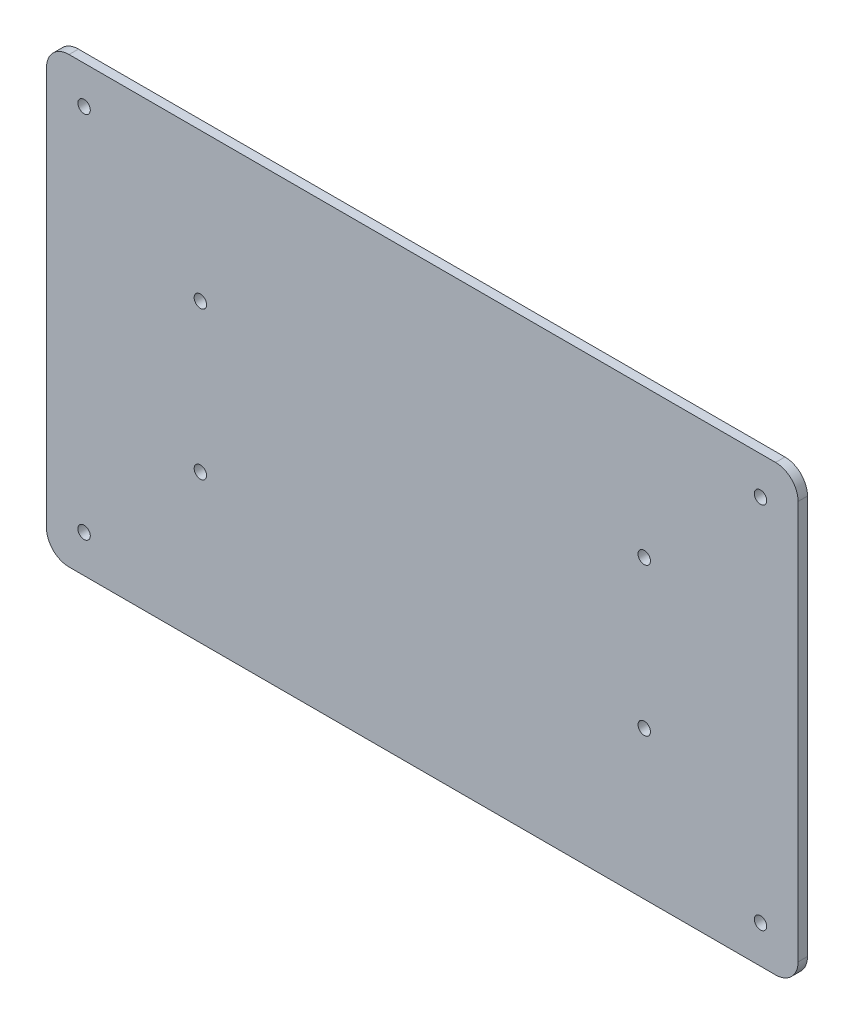
ISO-10303-21;
HEADER;
FILE_DESCRIPTION(('STEP AP214'),'2;1');
FILE_NAME('part.step','',(''),(''),'','','');
FILE_SCHEMA(('AUTOMOTIVE_DESIGN { 1 0 10303 214 1 1 1 1 }'));
ENDSEC;
DATA;
#1=APPLICATION_CONTEXT('core data for automotive mechanical design processes');
#2=APPLICATION_PROTOCOL_DEFINITION('international standard','automotive_design',2000,#1);
#3=PRODUCT_CONTEXT('',#1,'mechanical');
#4=PRODUCT('Part','Part','',(#3));
#5=PRODUCT_RELATED_PRODUCT_CATEGORY('part','',(#4));
#6=PRODUCT_DEFINITION_FORMATION('','',#4);
#7=PRODUCT_DEFINITION_CONTEXT('part definition',#1,'design');
#8=PRODUCT_DEFINITION('design','',#6,#7);
#9=PRODUCT_DEFINITION_SHAPE('','',#8);
#10=(LENGTH_UNIT() NAMED_UNIT(*) SI_UNIT(.MILLI.,.METRE.));
#11=(NAMED_UNIT(*) PLANE_ANGLE_UNIT() SI_UNIT($,.RADIAN.));
#12=(NAMED_UNIT(*) SI_UNIT($,.STERADIAN.) SOLID_ANGLE_UNIT());
#13=UNCERTAINTY_MEASURE_WITH_UNIT(LENGTH_MEASURE(1.E-05),#10,'distance_accuracy_value','');
#14=(GEOMETRIC_REPRESENTATION_CONTEXT(3) GLOBAL_UNCERTAINTY_ASSIGNED_CONTEXT((#13)) GLOBAL_UNIT_ASSIGNED_CONTEXT((#10,
#11,#12)) REPRESENTATION_CONTEXT('',''));
#15=CARTESIAN_POINT('',(0.,0.,0.));
#16=DIRECTION('',(0.,0.,1.));
#17=DIRECTION('',(1.,0.,0.));
#18=AXIS2_PLACEMENT_3D('',#15,#16,#17);
#19=CARTESIAN_POINT('',(-119.38,67.38,3.175));
#20=DIRECTION('',(0.,0.,1.));
#21=DIRECTION('',(1.,0.,0.));
#22=AXIS2_PLACEMENT_3D('',#19,#20,#21);
#23=PLANE('',#22);
#24=CARTESIAN_POINT('',(-74.9999999999999,25.,3.175));
#25=DIRECTION('',(0.,0.,1.));
#26=DIRECTION('',(1.,0.,0.));
#27=AXIS2_PLACEMENT_3D('',#24,#25,#26);
#28=CIRCLE('',#27,2.1);
#29=CARTESIAN_POINT('',(-72.8999999999999,25.,3.175));
#30=VERTEX_POINT('',#29);
#31=EDGE_CURVE('E430',#30,#30,#28,.T.);
#32=ORIENTED_EDGE('',*,*,#31,.F.);
#33=EDGE_LOOP('',(#32));
#34=FACE_BOUND('',#33,.T.);
#35=CARTESIAN_POINT('',(114.3,-62.3,3.175));
#36=DIRECTION('',(0.,0.,1.));
#37=DIRECTION('',(1.,0.,0.));
#38=AXIS2_PLACEMENT_3D('',#35,#36,#37);
#39=CIRCLE('',#38,2.1);
#40=CARTESIAN_POINT('',(116.4,-62.3,3.175));
#41=VERTEX_POINT('',#40);
#42=EDGE_CURVE('E418',#41,#41,#39,.T.);
#43=ORIENTED_EDGE('',*,*,#42,.F.);
#44=EDGE_LOOP('',(#43));
#45=FACE_BOUND('',#44,.T.);
#46=CARTESIAN_POINT('',(-114.3,62.3,3.175));
#47=DIRECTION('',(0.,0.,1.));
#48=DIRECTION('',(1.,0.,0.));
#49=AXIS2_PLACEMENT_3D('',#46,#47,#48);
#50=CIRCLE('',#49,2.0999958);
#51=CARTESIAN_POINT('',(-112.2000042,62.3,3.175));
#52=VERTEX_POINT('',#51);
#53=EDGE_CURVE('E406',#52,#52,#50,.T.);
#54=ORIENTED_EDGE('',*,*,#53,.F.);
#55=EDGE_LOOP('',(#54));
#56=FACE_BOUND('',#55,.T.);
#57=CARTESIAN_POINT('',(75.0000000000001,-25.,3.175));
#58=DIRECTION('',(0.,0.,1.));
#59=DIRECTION('',(1.,0.,0.));
#60=AXIS2_PLACEMENT_3D('',#57,#58,#59);
#61=CIRCLE('',#60,2.1);
#62=CARTESIAN_POINT('',(77.1000000000001,-25.,3.175));
#63=VERTEX_POINT('',#62);
#64=EDGE_CURVE('E349',#63,#63,#61,.T.);
#65=ORIENTED_EDGE('',*,*,#64,.F.);
#66=EDGE_LOOP('',(#65));
#67=FACE_BOUND('',#66,.T.);
#68=CARTESIAN_POINT('',(-119.38,67.38,3.175));
#69=DIRECTION('',(0.,0.,1.));
#70=DIRECTION('',(1.,0.,0.));
#71=AXIS2_PLACEMENT_3D('',#68,#69,#70);
#72=CIRCLE('',#71,7.62);
#73=CARTESIAN_POINT('',(-119.38,75.,3.175));
#74=VERTEX_POINT('',#73);
#75=CARTESIAN_POINT('',(-127.,67.3799999999999,3.175));
#76=VERTEX_POINT('',#75);
#77=EDGE_CURVE('E364',#74,#76,#72,.T.);
#78=ORIENTED_EDGE('',*,*,#77,.T.);
#79=DIRECTION('',(0.,-1.,0.));
#80=VECTOR('',#79,1.);
#81=CARTESIAN_POINT('',(-127.,67.3799999999999,3.175));
#82=LINE('',#81,#80);
#83=CARTESIAN_POINT('',(-127.,-67.3799999999999,3.175));
#84=VERTEX_POINT('',#83);
#85=EDGE_CURVE('E304',#76,#84,#82,.T.);
#86=ORIENTED_EDGE('',*,*,#85,.T.);
#87=CARTESIAN_POINT('',(-119.38,-67.38,3.175));
#88=DIRECTION('',(0.,0.,1.));
#89=DIRECTION('',(1.,0.,0.));
#90=AXIS2_PLACEMENT_3D('',#87,#88,#89);
#91=CIRCLE('',#90,7.62);
#92=CARTESIAN_POINT('',(-119.38,-75.,3.175));
#93=VERTEX_POINT('',#92);
#94=EDGE_CURVE('E379',#84,#93,#91,.T.);
#95=ORIENTED_EDGE('',*,*,#94,.T.);
#96=DIRECTION('',(1.,0.,0.));
#97=VECTOR('',#96,1.);
#98=CARTESIAN_POINT('',(-119.38,-75.,3.175));
#99=LINE('',#98,#97);
#100=CARTESIAN_POINT('',(119.38,-75.,3.175));
#101=VERTEX_POINT('',#100);
#102=EDGE_CURVE('E391',#93,#101,#99,.T.);
#103=ORIENTED_EDGE('',*,*,#102,.T.);
#104=CARTESIAN_POINT('',(119.38,-67.38,3.175));
#105=DIRECTION('',(0.,0.,1.));
#106=DIRECTION('',(1.,0.,0.));
#107=AXIS2_PLACEMENT_3D('',#104,#105,#106);
#108=CIRCLE('',#107,7.62);
#109=CARTESIAN_POINT('',(127.,-67.3799999999999,3.175));
#110=VERTEX_POINT('',#109);
#111=EDGE_CURVE('E337',#101,#110,#108,.T.);
#112=ORIENTED_EDGE('',*,*,#111,.T.);
#113=DIRECTION('',(0.,-1.,0.));
#114=VECTOR('',#113,1.);
#115=CARTESIAN_POINT('',(127.,67.3799999999999,3.175));
#116=LINE('',#115,#114);
#117=CARTESIAN_POINT('',(127.,67.3799999999999,3.175));
#118=VERTEX_POINT('',#117);
#119=EDGE_CURVE('E323',#118,#110,#116,.T.);
#120=ORIENTED_EDGE('',*,*,#119,.F.);
#121=CARTESIAN_POINT('',(119.38,67.38,3.175));
#122=DIRECTION('',(0.,0.,-1.));
#123=DIRECTION('',(-1.,0.,0.));
#124=AXIS2_PLACEMENT_3D('',#121,#122,#123);
#125=CIRCLE('',#124,7.62);
#126=CARTESIAN_POINT('',(119.38,75.,3.175));
#127=VERTEX_POINT('',#126);
#128=EDGE_CURVE('E335',#127,#118,#125,.T.);
#129=ORIENTED_EDGE('',*,*,#128,.F.);
#130=DIRECTION('',(1.,0.,0.));
#131=VECTOR('',#130,1.);
#132=CARTESIAN_POINT('',(-119.38,75.,3.175));
#133=LINE('',#132,#131);
#134=EDGE_CURVE('E341',#74,#127,#133,.T.);
#135=ORIENTED_EDGE('',*,*,#134,.F.);
#136=EDGE_LOOP('',(#78,#86,#95,#103,#112,#120,#129,#135));
#137=FACE_BOUND('',#136,.T.);
#138=CARTESIAN_POINT('',(75.0000000000001,25.,3.175));
#139=DIRECTION('',(0.,0.,1.));
#140=DIRECTION('',(1.,0.,0.));
#141=AXIS2_PLACEMENT_3D('',#138,#139,#140);
#142=CIRCLE('',#141,2.1);
#143=CARTESIAN_POINT('',(77.1000000000001,25.,3.175));
#144=VERTEX_POINT('',#143);
#145=EDGE_CURVE('E400',#144,#144,#142,.T.);
#146=ORIENTED_EDGE('',*,*,#145,.F.);
#147=EDGE_LOOP('',(#146));
#148=FACE_BOUND('',#147,.T.);
#149=CARTESIAN_POINT('',(114.3,62.3,3.175));
#150=DIRECTION('',(0.,0.,1.));
#151=DIRECTION('',(1.,0.,0.));
#152=AXIS2_PLACEMENT_3D('',#149,#150,#151);
#153=CIRCLE('',#152,2.1);
#154=CARTESIAN_POINT('',(116.4,62.3,3.175));
#155=VERTEX_POINT('',#154);
#156=EDGE_CURVE('E412',#155,#155,#153,.T.);
#157=ORIENTED_EDGE('',*,*,#156,.F.);
#158=EDGE_LOOP('',(#157));
#159=FACE_BOUND('',#158,.T.);
#160=CARTESIAN_POINT('',(-114.3,-62.3,3.175));
#161=DIRECTION('',(0.,0.,1.));
#162=DIRECTION('',(1.,0.,0.));
#163=AXIS2_PLACEMENT_3D('',#160,#161,#162);
#164=CIRCLE('',#163,2.1);
#165=CARTESIAN_POINT('',(-112.2,-62.3,3.175));
#166=VERTEX_POINT('',#165);
#167=EDGE_CURVE('E424',#166,#166,#164,.T.);
#168=ORIENTED_EDGE('',*,*,#167,.F.);
#169=EDGE_LOOP('',(#168));
#170=FACE_BOUND('',#169,.T.);
#171=CARTESIAN_POINT('',(-75.,-25.,3.175));
#172=DIRECTION('',(0.,0.,1.));
#173=DIRECTION('',(1.,0.,0.));
#174=AXIS2_PLACEMENT_3D('',#171,#172,#173);
#175=CIRCLE('',#174,2.1);
#176=CARTESIAN_POINT('',(-72.8999999999999,-25.,3.175));
#177=VERTEX_POINT('',#176);
#178=EDGE_CURVE('E436',#177,#177,#175,.T.);
#179=ORIENTED_EDGE('',*,*,#178,.F.);
#180=EDGE_LOOP('',(#179));
#181=FACE_BOUND('',#180,.T.);
#182=ADVANCED_FACE('F249',(#34,#45,#56,#67,#137,#148,#159,#170,#181),#23,.T.);
#183=CARTESIAN_POINT('',(-119.38,67.38,0.));
#184=DIRECTION('',(0.,0.,1.));
#185=DIRECTION('',(1.,0.,0.));
#186=AXIS2_PLACEMENT_3D('',#183,#184,#185);
#187=PLANE('',#186);
#188=CARTESIAN_POINT('',(-119.38,67.38,0.));
#189=DIRECTION('',(0.,0.,1.));
#190=DIRECTION('',(1.,0.,0.));
#191=AXIS2_PLACEMENT_3D('',#188,#189,#190);
#192=CIRCLE('',#191,7.62);
#193=CARTESIAN_POINT('',(-119.38,75.,0.));
#194=VERTEX_POINT('',#193);
#195=CARTESIAN_POINT('',(-127.,67.3799999999999,0.));
#196=VERTEX_POINT('',#195);
#197=EDGE_CURVE('E346',#194,#196,#192,.T.);
#198=ORIENTED_EDGE('',*,*,#197,.F.);
#199=DIRECTION('',(1.,0.,0.));
#200=VECTOR('',#199,1.);
#201=CARTESIAN_POINT('',(-119.38,75.,0.));
#202=LINE('',#201,#200);
#203=CARTESIAN_POINT('',(119.38,75.,0.));
#204=VERTEX_POINT('',#203);
#205=EDGE_CURVE('E361',#194,#204,#202,.T.);
#206=ORIENTED_EDGE('',*,*,#205,.T.);
#207=CARTESIAN_POINT('',(119.38,67.38,0.));
#208=DIRECTION('',(0.,0.,-1.));
#209=DIRECTION('',(-1.,0.,0.));
#210=AXIS2_PLACEMENT_3D('',#207,#208,#209);
#211=CIRCLE('',#210,7.62);
#212=CARTESIAN_POINT('',(127.,67.3799999999999,0.));
#213=VERTEX_POINT('',#212);
#214=EDGE_CURVE('E359',#204,#213,#211,.T.);
#215=ORIENTED_EDGE('',*,*,#214,.T.);
#216=DIRECTION('',(0.,-1.,0.));
#217=VECTOR('',#216,1.);
#218=CARTESIAN_POINT('',(127.,67.3799999999999,0.));
#219=LINE('',#218,#217);
#220=CARTESIAN_POINT('',(127.,-67.3799999999999,0.));
#221=VERTEX_POINT('',#220);
#222=EDGE_CURVE('E325',#213,#221,#219,.T.);
#223=ORIENTED_EDGE('',*,*,#222,.T.);
#224=CARTESIAN_POINT('',(119.38,-67.38,0.));
#225=DIRECTION('',(0.,0.,1.));
#226=DIRECTION('',(1.,0.,0.));
#227=AXIS2_PLACEMENT_3D('',#224,#225,#226);
#228=CIRCLE('',#227,7.62);
#229=CARTESIAN_POINT('',(119.38,-75.,0.));
#230=VERTEX_POINT('',#229);
#231=EDGE_CURVE('E355',#230,#221,#228,.T.);
#232=ORIENTED_EDGE('',*,*,#231,.F.);
#233=DIRECTION('',(1.,0.,0.));
#234=VECTOR('',#233,1.);
#235=CARTESIAN_POINT('',(-119.38,-75.,0.));
#236=LINE('',#235,#234);
#237=CARTESIAN_POINT('',(-119.38,-75.,0.));
#238=VERTEX_POINT('',#237);
#239=EDGE_CURVE('E353',#238,#230,#236,.T.);
#240=ORIENTED_EDGE('',*,*,#239,.F.);
#241=CARTESIAN_POINT('',(-119.38,-67.38,0.));
#242=DIRECTION('',(0.,0.,1.));
#243=DIRECTION('',(1.,0.,0.));
#244=AXIS2_PLACEMENT_3D('',#241,#242,#243);
#245=CIRCLE('',#244,7.62);
#246=CARTESIAN_POINT('',(-127.,-67.3799999999999,0.));
#247=VERTEX_POINT('',#246);
#248=EDGE_CURVE('E351',#247,#238,#245,.T.);
#249=ORIENTED_EDGE('',*,*,#248,.F.);
#250=DIRECTION('',(0.,-1.,0.));
#251=VECTOR('',#250,1.);
#252=CARTESIAN_POINT('',(-127.,67.3799999999999,0.));
#253=LINE('',#252,#251);
#254=EDGE_CURVE('E348',#196,#247,#253,.T.);
#255=ORIENTED_EDGE('',*,*,#254,.F.);
#256=EDGE_LOOP('',(#198,#206,#215,#223,#232,#240,#249,#255));
#257=FACE_BOUND('',#256,.T.);
#258=CARTESIAN_POINT('',(75.0000000000001,-25.,0.));
#259=DIRECTION('',(0.,0.,1.));
#260=DIRECTION('',(1.,0.,0.));
#261=AXIS2_PLACEMENT_3D('',#258,#259,#260);
#262=CIRCLE('',#261,2.1);
#263=CARTESIAN_POINT('',(77.1000000000001,-25.,0.));
#264=VERTEX_POINT('',#263);
#265=EDGE_CURVE('E397',#264,#264,#262,.T.);
#266=ORIENTED_EDGE('',*,*,#265,.T.);
#267=EDGE_LOOP('',(#266));
#268=FACE_BOUND('',#267,.T.);
#269=CARTESIAN_POINT('',(75.0000000000001,25.,0.));
#270=DIRECTION('',(0.,0.,1.));
#271=DIRECTION('',(1.,0.,0.));
#272=AXIS2_PLACEMENT_3D('',#269,#270,#271);
#273=CIRCLE('',#272,2.1);
#274=CARTESIAN_POINT('',(77.1000000000001,25.,0.));
#275=VERTEX_POINT('',#274);
#276=EDGE_CURVE('E403',#275,#275,#273,.T.);
#277=ORIENTED_EDGE('',*,*,#276,.T.);
#278=EDGE_LOOP('',(#277));
#279=FACE_BOUND('',#278,.T.);
#280=CARTESIAN_POINT('',(-114.3,62.3,0.));
#281=DIRECTION('',(0.,0.,1.));
#282=DIRECTION('',(1.,0.,0.));
#283=AXIS2_PLACEMENT_3D('',#280,#281,#282);
#284=CIRCLE('',#283,2.0999958);
#285=CARTESIAN_POINT('',(-112.2000042,62.3,0.));
#286=VERTEX_POINT('',#285);
#287=EDGE_CURVE('E409',#286,#286,#284,.T.);
#288=ORIENTED_EDGE('',*,*,#287,.T.);
#289=EDGE_LOOP('',(#288));
#290=FACE_BOUND('',#289,.T.);
#291=CARTESIAN_POINT('',(114.3,62.3,0.));
#292=DIRECTION('',(0.,0.,1.));
#293=DIRECTION('',(1.,0.,0.));
#294=AXIS2_PLACEMENT_3D('',#291,#292,#293);
#295=CIRCLE('',#294,2.1);
#296=CARTESIAN_POINT('',(116.4,62.3,0.));
#297=VERTEX_POINT('',#296);
#298=EDGE_CURVE('E415',#297,#297,#295,.T.);
#299=ORIENTED_EDGE('',*,*,#298,.T.);
#300=EDGE_LOOP('',(#299));
#301=FACE_BOUND('',#300,.T.);
#302=CARTESIAN_POINT('',(114.3,-62.3,0.));
#303=DIRECTION('',(0.,0.,1.));
#304=DIRECTION('',(1.,0.,0.));
#305=AXIS2_PLACEMENT_3D('',#302,#303,#304);
#306=CIRCLE('',#305,2.1);
#307=CARTESIAN_POINT('',(116.4,-62.3,0.));
#308=VERTEX_POINT('',#307);
#309=EDGE_CURVE('E421',#308,#308,#306,.T.);
#310=ORIENTED_EDGE('',*,*,#309,.T.);
#311=EDGE_LOOP('',(#310));
#312=FACE_BOUND('',#311,.T.);
#313=CARTESIAN_POINT('',(-114.3,-62.3,0.));
#314=DIRECTION('',(0.,0.,1.));
#315=DIRECTION('',(1.,0.,0.));
#316=AXIS2_PLACEMENT_3D('',#313,#314,#315);
#317=CIRCLE('',#316,2.1);
#318=CARTESIAN_POINT('',(-112.2,-62.3,0.));
#319=VERTEX_POINT('',#318);
#320=EDGE_CURVE('E427',#319,#319,#317,.T.);
#321=ORIENTED_EDGE('',*,*,#320,.T.);
#322=EDGE_LOOP('',(#321));
#323=FACE_BOUND('',#322,.T.);
#324=CARTESIAN_POINT('',(-74.9999999999999,25.,0.));
#325=DIRECTION('',(0.,0.,1.));
#326=DIRECTION('',(1.,0.,0.));
#327=AXIS2_PLACEMENT_3D('',#324,#325,#326);
#328=CIRCLE('',#327,2.1);
#329=CARTESIAN_POINT('',(-72.8999999999999,25.,0.));
#330=VERTEX_POINT('',#329);
#331=EDGE_CURVE('E433',#330,#330,#328,.T.);
#332=ORIENTED_EDGE('',*,*,#331,.T.);
#333=EDGE_LOOP('',(#332));
#334=FACE_BOUND('',#333,.T.);
#335=CARTESIAN_POINT('',(-75.,-25.,0.));
#336=DIRECTION('',(0.,0.,1.));
#337=DIRECTION('',(1.,0.,0.));
#338=AXIS2_PLACEMENT_3D('',#335,#336,#337);
#339=CIRCLE('',#338,2.1);
#340=CARTESIAN_POINT('',(-72.8999999999999,-25.,0.));
#341=VERTEX_POINT('',#340);
#342=EDGE_CURVE('E439',#341,#341,#339,.T.);
#343=ORIENTED_EDGE('',*,*,#342,.T.);
#344=EDGE_LOOP('',(#343));
#345=FACE_BOUND('',#344,.T.);
#346=ADVANCED_FACE('F382',(#257,#268,#279,#290,#301,#312,#323,#334,#345),#187,.F.);
#347=CARTESIAN_POINT('',(-119.38,67.38,3.175));
#348=DIRECTION('',(0.,0.,-1.));
#349=DIRECTION('',(-1.,0.,0.));
#350=AXIS2_PLACEMENT_3D('',#347,#348,#349);
#351=CYLINDRICAL_SURFACE('',#350,7.62);
#352=ORIENTED_EDGE('',*,*,#197,.T.);
#353=DIRECTION('',(0.,0.,-1.));
#354=VECTOR('',#353,1.);
#355=CARTESIAN_POINT('',(-127.,67.3799999999999,3.175));
#356=LINE('',#355,#354);
#357=EDGE_CURVE('E12',#76,#196,#356,.T.);
#358=ORIENTED_EDGE('',*,*,#357,.F.);
#359=ORIENTED_EDGE('',*,*,#77,.F.);
#360=DIRECTION('',(0.,0.,-1.));
#361=VECTOR('',#360,1.);
#362=CARTESIAN_POINT('',(-119.38,75.,3.175));
#363=LINE('',#362,#361);
#364=EDGE_CURVE('E266',#74,#194,#363,.T.);
#365=ORIENTED_EDGE('',*,*,#364,.T.);
#366=EDGE_LOOP('',(#352,#358,#359,#365));
#367=FACE_BOUND('',#366,.T.);
#368=ADVANCED_FACE('F251',(#367),#351,.T.);
#369=CARTESIAN_POINT('',(-127.,67.3799999999999,3.175));
#370=DIRECTION('',(1.,0.,0.));
#371=DIRECTION('',(0.,1.,0.));
#372=AXIS2_PLACEMENT_3D('',#369,#370,#371);
#373=PLANE('',#372);
#374=ORIENTED_EDGE('',*,*,#254,.T.);
#375=DIRECTION('',(0.,0.,-1.));
#376=VECTOR('',#375,1.);
#377=CARTESIAN_POINT('',(-127.,-67.3799999999999,3.175));
#378=LINE('',#377,#376);
#379=EDGE_CURVE('E258',#84,#247,#378,.T.);
#380=ORIENTED_EDGE('',*,*,#379,.F.);
#381=ORIENTED_EDGE('',*,*,#85,.F.);
#382=ORIENTED_EDGE('',*,*,#357,.T.);
#383=EDGE_LOOP('',(#374,#380,#381,#382));
#384=FACE_BOUND('',#383,.T.);
#385=ADVANCED_FACE('F473',(#384),#373,.F.);
#386=CARTESIAN_POINT('',(-119.38,-67.38,3.175));
#387=DIRECTION('',(0.,0.,-1.));
#388=DIRECTION('',(-1.,0.,0.));
#389=AXIS2_PLACEMENT_3D('',#386,#387,#388);
#390=CYLINDRICAL_SURFACE('',#389,7.62);
#391=ORIENTED_EDGE('',*,*,#248,.T.);
#392=DIRECTION('',(0.,0.,-1.));
#393=VECTOR('',#392,1.);
#394=CARTESIAN_POINT('',(-119.38,-75.,3.175));
#395=LINE('',#394,#393);
#396=EDGE_CURVE('E371',#93,#238,#395,.T.);
#397=ORIENTED_EDGE('',*,*,#396,.F.);
#398=ORIENTED_EDGE('',*,*,#94,.F.);
#399=ORIENTED_EDGE('',*,*,#379,.T.);
#400=EDGE_LOOP('',(#391,#397,#398,#399));
#401=FACE_BOUND('',#400,.T.);
#402=ADVANCED_FACE('F377',(#401),#390,.T.);
#403=CARTESIAN_POINT('',(-119.38,-75.,3.175));
#404=DIRECTION('',(0.,1.,0.));
#405=DIRECTION('',(0.,0.,1.));
#406=AXIS2_PLACEMENT_3D('',#403,#404,#405);
#407=PLANE('',#406);
#408=ORIENTED_EDGE('',*,*,#239,.T.);
#409=DIRECTION('',(0.,0.,-1.));
#410=VECTOR('',#409,1.);
#411=CARTESIAN_POINT('',(119.38,-75.,3.175));
#412=LINE('',#411,#410);
#413=EDGE_CURVE('E368',#101,#230,#412,.T.);
#414=ORIENTED_EDGE('',*,*,#413,.F.);
#415=ORIENTED_EDGE('',*,*,#102,.F.);
#416=ORIENTED_EDGE('',*,*,#396,.T.);
#417=EDGE_LOOP('',(#408,#414,#415,#416));
#418=FACE_BOUND('',#417,.T.);
#419=ADVANCED_FACE('F387',(#418),#407,.F.);
#420=CARTESIAN_POINT('',(119.38,-67.38,3.175));
#421=DIRECTION('',(0.,0.,-1.));
#422=DIRECTION('',(-1.,0.,0.));
#423=AXIS2_PLACEMENT_3D('',#420,#421,#422);
#424=CYLINDRICAL_SURFACE('',#423,7.62);
#425=ORIENTED_EDGE('',*,*,#231,.T.);
#426=DIRECTION('',(0.,0.,-1.));
#427=VECTOR('',#426,1.);
#428=CARTESIAN_POINT('',(127.,-67.3799999999999,3.175));
#429=LINE('',#428,#427);
#430=EDGE_CURVE('E329',#110,#221,#429,.T.);
#431=ORIENTED_EDGE('',*,*,#430,.F.);
#432=ORIENTED_EDGE('',*,*,#111,.F.);
#433=ORIENTED_EDGE('',*,*,#413,.T.);
#434=EDGE_LOOP('',(#425,#431,#432,#433));
#435=FACE_BOUND('',#434,.T.);
#436=ADVANCED_FACE('F390',(#435),#424,.T.);
#437=CARTESIAN_POINT('',(127.,67.3799999999999,3.175));
#438=DIRECTION('',(1.,0.,0.));
#439=DIRECTION('',(0.,1.,0.));
#440=AXIS2_PLACEMENT_3D('',#437,#438,#439);
#441=PLANE('',#440);
#442=ORIENTED_EDGE('',*,*,#222,.F.);
#443=DIRECTION('',(0.,0.,-1.));
#444=VECTOR('',#443,1.);
#445=CARTESIAN_POINT('',(127.,67.3799999999999,3.175));
#446=LINE('',#445,#444);
#447=EDGE_CURVE('E320',#118,#213,#446,.T.);
#448=ORIENTED_EDGE('',*,*,#447,.F.);
#449=ORIENTED_EDGE('',*,*,#119,.T.);
#450=ORIENTED_EDGE('',*,*,#430,.T.);
#451=EDGE_LOOP('',(#442,#448,#449,#450));
#452=FACE_BOUND('',#451,.T.);
#453=ADVANCED_FACE('F322',(#452),#441,.T.);
#454=CARTESIAN_POINT('',(119.38,67.38,3.175));
#455=DIRECTION('',(0.,0.,-1.));
#456=DIRECTION('',(-1.,0.,0.));
#457=AXIS2_PLACEMENT_3D('',#454,#455,#456);
#458=CYLINDRICAL_SURFACE('',#457,7.62);
#459=ORIENTED_EDGE('',*,*,#214,.F.);
#460=DIRECTION('',(0.,0.,-1.));
#461=VECTOR('',#460,1.);
#462=CARTESIAN_POINT('',(119.38,75.,3.175));
#463=LINE('',#462,#461);
#464=EDGE_CURVE('E292',#127,#204,#463,.T.);
#465=ORIENTED_EDGE('',*,*,#464,.F.);
#466=ORIENTED_EDGE('',*,*,#128,.T.);
#467=ORIENTED_EDGE('',*,*,#447,.T.);
#468=EDGE_LOOP('',(#459,#465,#466,#467));
#469=FACE_BOUND('',#468,.T.);
#470=ADVANCED_FACE('F340',(#469),#458,.T.);
#471=CARTESIAN_POINT('',(-119.38,75.,3.175));
#472=DIRECTION('',(0.,1.,0.));
#473=DIRECTION('',(0.,0.,1.));
#474=AXIS2_PLACEMENT_3D('',#471,#472,#473);
#475=PLANE('',#474);
#476=ORIENTED_EDGE('',*,*,#205,.F.);
#477=ORIENTED_EDGE('',*,*,#364,.F.);
#478=ORIENTED_EDGE('',*,*,#134,.T.);
#479=ORIENTED_EDGE('',*,*,#464,.T.);
#480=EDGE_LOOP('',(#476,#477,#478,#479));
#481=FACE_BOUND('',#480,.T.);
#482=ADVANCED_FACE('F461',(#481),#475,.T.);
#483=CARTESIAN_POINT('',(75.0000000000001,-25.,3.175));
#484=DIRECTION('',(0.,0.,-1.));
#485=DIRECTION('',(-1.,0.,0.));
#486=AXIS2_PLACEMENT_3D('',#483,#484,#485);
#487=CYLINDRICAL_SURFACE('',#486,2.1);
#488=ORIENTED_EDGE('',*,*,#64,.T.);
#489=EDGE_LOOP('',(#488));
#490=FACE_BOUND('',#489,.T.);
#491=ORIENTED_EDGE('',*,*,#265,.F.);
#492=EDGE_LOOP('',(#491));
#493=FACE_BOUND('',#492,.T.);
#494=ADVANCED_FACE('F458',(#490,#493),#487,.F.);
#495=CARTESIAN_POINT('',(75.0000000000001,25.,3.175));
#496=DIRECTION('',(0.,0.,-1.));
#497=DIRECTION('',(-1.,0.,0.));
#498=AXIS2_PLACEMENT_3D('',#495,#496,#497);
#499=CYLINDRICAL_SURFACE('',#498,2.1);
#500=ORIENTED_EDGE('',*,*,#145,.T.);
#501=EDGE_LOOP('',(#500));
#502=FACE_BOUND('',#501,.T.);
#503=ORIENTED_EDGE('',*,*,#276,.F.);
#504=EDGE_LOOP('',(#503));
#505=FACE_BOUND('',#504,.T.);
#506=ADVANCED_FACE('F541',(#502,#505),#499,.F.);
#507=CARTESIAN_POINT('',(-114.3,62.3,3.175));
#508=DIRECTION('',(0.,0.,-1.));
#509=DIRECTION('',(-1.,0.,0.));
#510=AXIS2_PLACEMENT_3D('',#507,#508,#509);
#511=CYLINDRICAL_SURFACE('',#510,2.0999958);
#512=ORIENTED_EDGE('',*,*,#53,.T.);
#513=EDGE_LOOP('',(#512));
#514=FACE_BOUND('',#513,.T.);
#515=ORIENTED_EDGE('',*,*,#287,.F.);
#516=EDGE_LOOP('',(#515));
#517=FACE_BOUND('',#516,.T.);
#518=ADVANCED_FACE('F549',(#514,#517),#511,.F.);
#519=CARTESIAN_POINT('',(114.3,62.3,3.175));
#520=DIRECTION('',(0.,0.,-1.));
#521=DIRECTION('',(-1.,0.,0.));
#522=AXIS2_PLACEMENT_3D('',#519,#520,#521);
#523=CYLINDRICAL_SURFACE('',#522,2.1);
#524=ORIENTED_EDGE('',*,*,#156,.T.);
#525=EDGE_LOOP('',(#524));
#526=FACE_BOUND('',#525,.T.);
#527=ORIENTED_EDGE('',*,*,#298,.F.);
#528=EDGE_LOOP('',(#527));
#529=FACE_BOUND('',#528,.T.);
#530=ADVANCED_FACE('F557',(#526,#529),#523,.F.);
#531=CARTESIAN_POINT('',(114.3,-62.3,3.175));
#532=DIRECTION('',(0.,0.,-1.));
#533=DIRECTION('',(-1.,0.,0.));
#534=AXIS2_PLACEMENT_3D('',#531,#532,#533);
#535=CYLINDRICAL_SURFACE('',#534,2.1);
#536=ORIENTED_EDGE('',*,*,#42,.T.);
#537=EDGE_LOOP('',(#536));
#538=FACE_BOUND('',#537,.T.);
#539=ORIENTED_EDGE('',*,*,#309,.F.);
#540=EDGE_LOOP('',(#539));
#541=FACE_BOUND('',#540,.T.);
#542=ADVANCED_FACE('F566',(#538,#541),#535,.F.);
#543=CARTESIAN_POINT('',(-114.3,-62.3,3.175));
#544=DIRECTION('',(0.,0.,-1.));
#545=DIRECTION('',(-1.,0.,0.));
#546=AXIS2_PLACEMENT_3D('',#543,#544,#545);
#547=CYLINDRICAL_SURFACE('',#546,2.1);
#548=ORIENTED_EDGE('',*,*,#167,.T.);
#549=EDGE_LOOP('',(#548));
#550=FACE_BOUND('',#549,.T.);
#551=ORIENTED_EDGE('',*,*,#320,.F.);
#552=EDGE_LOOP('',(#551));
#553=FACE_BOUND('',#552,.T.);
#554=ADVANCED_FACE('F575',(#550,#553),#547,.F.);
#555=CARTESIAN_POINT('',(-74.9999999999999,25.,3.175));
#556=DIRECTION('',(0.,0.,-1.));
#557=DIRECTION('',(-1.,0.,0.));
#558=AXIS2_PLACEMENT_3D('',#555,#556,#557);
#559=CYLINDRICAL_SURFACE('',#558,2.1);
#560=ORIENTED_EDGE('',*,*,#31,.T.);
#561=EDGE_LOOP('',(#560));
#562=FACE_BOUND('',#561,.T.);
#563=ORIENTED_EDGE('',*,*,#331,.F.);
#564=EDGE_LOOP('',(#563));
#565=FACE_BOUND('',#564,.T.);
#566=ADVANCED_FACE('F584',(#562,#565),#559,.F.);
#567=CARTESIAN_POINT('',(-75.,-25.,3.175));
#568=DIRECTION('',(0.,0.,-1.));
#569=DIRECTION('',(-1.,0.,0.));
#570=AXIS2_PLACEMENT_3D('',#567,#568,#569);
#571=CYLINDRICAL_SURFACE('',#570,2.1);
#572=ORIENTED_EDGE('',*,*,#178,.T.);
#573=EDGE_LOOP('',(#572));
#574=FACE_BOUND('',#573,.T.);
#575=ORIENTED_EDGE('',*,*,#342,.F.);
#576=EDGE_LOOP('',(#575));
#577=FACE_BOUND('',#576,.T.);
#578=ADVANCED_FACE('F445',(#574,#577),#571,.F.);
#579=CLOSED_SHELL('',(#182,#346,#368,#385,#402,#419,#436,#453,#470,#482,#494,#506,#518,#530,
#542,#554,#566,#578));
#580=MANIFOLD_SOLID_BREP('B2',#579);
#581=ADVANCED_BREP_SHAPE_REPRESENTATION('',(#18,#580),#14);
#582=SHAPE_DEFINITION_REPRESENTATION(#9,#581);
ENDSEC;
END-ISO-10303-21;
